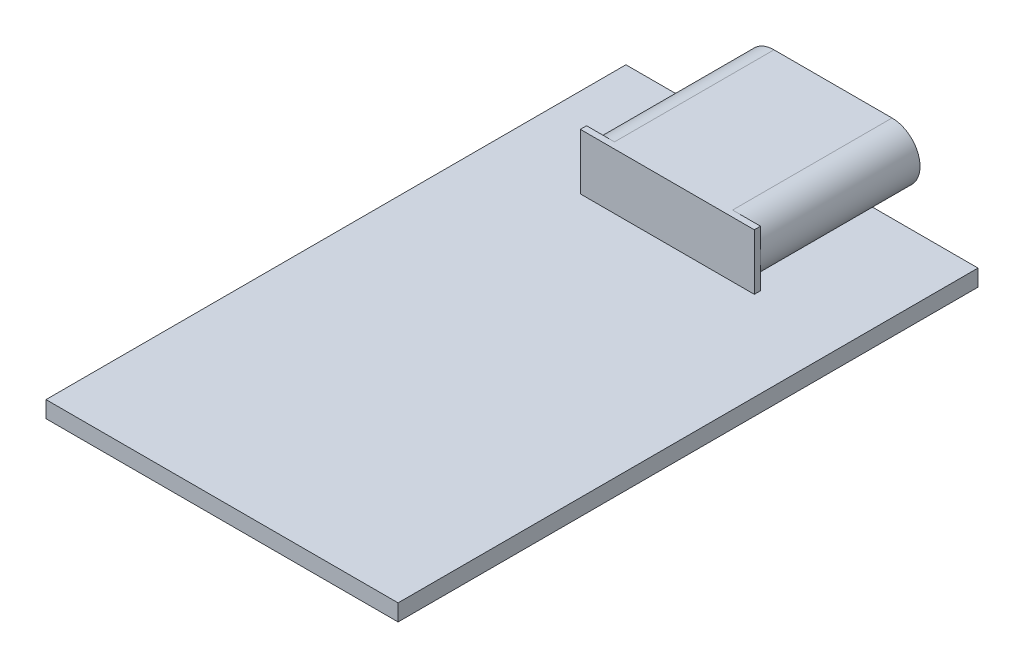
ISO-10303-21;
HEADER;
FILE_DESCRIPTION(('STEP AP214'),'2;1');
FILE_NAME('part.step','',(''),(''),'','','');
FILE_SCHEMA(('AUTOMOTIVE_DESIGN { 1 0 10303 214 1 1 1 1 }'));
ENDSEC;
DATA;
#1=APPLICATION_CONTEXT('core data for automotive mechanical design processes');
#2=APPLICATION_PROTOCOL_DEFINITION('international standard','automotive_design',2000,#1);
#3=PRODUCT_CONTEXT('',#1,'mechanical');
#4=PRODUCT('Part','Part','',(#3));
#5=PRODUCT_RELATED_PRODUCT_CATEGORY('part','',(#4));
#6=PRODUCT_DEFINITION_FORMATION('','',#4);
#7=PRODUCT_DEFINITION_CONTEXT('part definition',#1,'design');
#8=PRODUCT_DEFINITION('design','',#6,#7);
#9=PRODUCT_DEFINITION_SHAPE('','',#8);
#10=(LENGTH_UNIT() NAMED_UNIT(*) SI_UNIT(.MILLI.,.METRE.));
#11=(NAMED_UNIT(*) PLANE_ANGLE_UNIT() SI_UNIT($,.RADIAN.));
#12=(NAMED_UNIT(*) SI_UNIT($,.STERADIAN.) SOLID_ANGLE_UNIT());
#13=UNCERTAINTY_MEASURE_WITH_UNIT(LENGTH_MEASURE(1.E-05),#10,'distance_accuracy_value','');
#14=(GEOMETRIC_REPRESENTATION_CONTEXT(3) GLOBAL_UNCERTAINTY_ASSIGNED_CONTEXT((#13)) GLOBAL_UNIT_ASSIGNED_CONTEXT((#10,
#11,#12)) REPRESENTATION_CONTEXT('',''));
#15=CARTESIAN_POINT('',(0.,0.,0.));
#16=DIRECTION('',(0.,0.,1.));
#17=DIRECTION('',(1.,0.,0.));
#18=AXIS2_PLACEMENT_3D('',#15,#16,#17);
#19=CARTESIAN_POINT('',(4.2,3.5,-15.5));
#20=DIRECTION('',(-1.,0.,0.));
#21=DIRECTION('',(0.,0.,1.));
#22=AXIS2_PLACEMENT_3D('',#19,#20,#21);
#23=PLANE('',#22);
#24=DIRECTION('',(0.,-1.,0.));
#25=VECTOR('',#24,1.);
#26=CARTESIAN_POINT('',(4.2,0.,-7.8));
#27=LINE('',#26,#25);
#28=CARTESIAN_POINT('',(4.2,2.15,-7.8));
#29=VERTEX_POINT('',#28);
#30=CARTESIAN_POINT('',(4.2,0.800000000000001,-7.8));
#31=VERTEX_POINT('',#30);
#32=EDGE_CURVE('E280',#29,#31,#27,.T.);
#33=ORIENTED_EDGE('',*,*,#32,.F.);
#34=DIRECTION('',(0.,-1.,0.));
#35=VECTOR('',#34,1.);
#36=CARTESIAN_POINT('',(4.2,0.,-7.8));
#37=LINE('',#36,#35);
#38=CARTESIAN_POINT('',(4.2,3.5,-7.8));
#39=VERTEX_POINT('',#38);
#40=EDGE_CURVE('E295',#39,#29,#37,.T.);
#41=ORIENTED_EDGE('',*,*,#40,.F.);
#42=DIRECTION('',(0.,0.,-1.));
#43=VECTOR('',#42,1.);
#44=CARTESIAN_POINT('',(4.2,3.5,-15.5));
#45=LINE('',#44,#43);
#46=CARTESIAN_POINT('',(4.2,3.5,-7.5));
#47=VERTEX_POINT('',#46);
#48=EDGE_CURVE('E323',#47,#39,#45,.T.);
#49=ORIENTED_EDGE('',*,*,#48,.F.);
#50=DIRECTION('',(0.,-1.,0.));
#51=VECTOR('',#50,1.);
#52=CARTESIAN_POINT('',(4.2,3.5,-7.5));
#53=LINE('',#52,#51);
#54=CARTESIAN_POINT('',(4.2,0.8,-7.5));
#55=VERTEX_POINT('',#54);
#56=EDGE_CURVE('E337',#47,#55,#53,.T.);
#57=ORIENTED_EDGE('',*,*,#56,.T.);
#58=DIRECTION('',(0.,0.,-1.));
#59=VECTOR('',#58,1.);
#60=CARTESIAN_POINT('',(4.2,0.8,-15.5));
#61=LINE('',#60,#59);
#62=EDGE_CURVE('E298',#55,#31,#61,.T.);
#63=ORIENTED_EDGE('',*,*,#62,.T.);
#64=EDGE_LOOP('',(#33,#41,#49,#57,#63));
#65=FACE_BOUND('',#64,.T.);
#66=ADVANCED_FACE('F127',(#65),#23,.F.);
#67=CARTESIAN_POINT('',(-4.2,3.5,-15.5));
#68=DIRECTION('',(0.,0.,1.));
#69=DIRECTION('',(1.,0.,0.));
#70=AXIS2_PLACEMENT_3D('',#67,#68,#69);
#71=PLANE('',#70);
#72=CARTESIAN_POINT('',(-2.85,2.15,-15.5));
#73=DIRECTION('',(0.,0.,-1.));
#74=DIRECTION('',(-1.,0.,0.));
#75=AXIS2_PLACEMENT_3D('',#72,#73,#74);
#76=CIRCLE('',#75,1.1);
#77=CARTESIAN_POINT('',(-2.85,1.05,-15.5));
#78=VERTEX_POINT('',#77);
#79=CARTESIAN_POINT('',(-2.85,3.25,-15.5));
#80=VERTEX_POINT('',#79);
#81=EDGE_CURVE('E494',#78,#80,#76,.T.);
#82=ORIENTED_EDGE('',*,*,#81,.F.);
#83=DIRECTION('',(-1.,0.,0.));
#84=VECTOR('',#83,1.);
#85=CARTESIAN_POINT('',(0.,1.05,-15.5));
#86=LINE('',#85,#84);
#87=CARTESIAN_POINT('',(2.85,1.05,-15.5));
#88=VERTEX_POINT('',#87);
#89=EDGE_CURVE('E152',#88,#78,#86,.T.);
#90=ORIENTED_EDGE('',*,*,#89,.F.);
#91=CARTESIAN_POINT('',(2.85,2.15,-15.5));
#92=DIRECTION('',(0.,0.,-1.));
#93=DIRECTION('',(-1.,0.,0.));
#94=AXIS2_PLACEMENT_3D('',#91,#92,#93);
#95=CIRCLE('',#94,1.1);
#96=CARTESIAN_POINT('',(2.85,3.25,-15.5));
#97=VERTEX_POINT('',#96);
#98=EDGE_CURVE('E452',#97,#88,#95,.T.);
#99=ORIENTED_EDGE('',*,*,#98,.F.);
#100=DIRECTION('',(-1.,0.,0.));
#101=VECTOR('',#100,1.);
#102=CARTESIAN_POINT('',(0.,3.25,-15.5));
#103=LINE('',#102,#101);
#104=EDGE_CURVE('E498',#97,#80,#103,.T.);
#105=ORIENTED_EDGE('',*,*,#104,.T.);
#106=EDGE_LOOP('',(#82,#90,#99,#105));
#107=FACE_BOUND('',#106,.T.);
#108=CARTESIAN_POINT('',(2.85,2.15,-15.5));
#109=DIRECTION('',(0.,0.,-1.));
#110=DIRECTION('',(-1.,0.,0.));
#111=AXIS2_PLACEMENT_3D('',#108,#109,#110);
#112=CIRCLE('',#111,1.35);
#113=CARTESIAN_POINT('',(2.85,3.5,-15.5));
#114=VERTEX_POINT('',#113);
#115=CARTESIAN_POINT('',(2.85,0.8,-15.5));
#116=VERTEX_POINT('',#115);
#117=EDGE_CURVE('E310',#114,#116,#112,.T.);
#118=ORIENTED_EDGE('',*,*,#117,.T.);
#119=DIRECTION('',(-1.,0.,0.));
#120=VECTOR('',#119,1.);
#121=CARTESIAN_POINT('',(-4.2,0.8,-15.5));
#122=LINE('',#121,#120);
#123=CARTESIAN_POINT('',(-2.85,0.8,-15.5));
#124=VERTEX_POINT('',#123);
#125=EDGE_CURVE('E340',#116,#124,#122,.T.);
#126=ORIENTED_EDGE('',*,*,#125,.T.);
#127=CARTESIAN_POINT('',(-2.85,2.15,-15.5));
#128=DIRECTION('',(0.,0.,-1.));
#129=DIRECTION('',(-1.,0.,0.));
#130=AXIS2_PLACEMENT_3D('',#127,#128,#129);
#131=CIRCLE('',#130,1.35);
#132=CARTESIAN_POINT('',(-2.85,3.5,-15.5));
#133=VERTEX_POINT('',#132);
#134=EDGE_CURVE('E508',#124,#133,#131,.T.);
#135=ORIENTED_EDGE('',*,*,#134,.T.);
#136=DIRECTION('',(-1.,0.,0.));
#137=VECTOR('',#136,1.);
#138=CARTESIAN_POINT('',(-4.2,3.5,-15.5));
#139=LINE('',#138,#137);
#140=EDGE_CURVE('E326',#114,#133,#139,.T.);
#141=ORIENTED_EDGE('',*,*,#140,.F.);
#142=EDGE_LOOP('',(#118,#126,#135,#141));
#143=FACE_BOUND('',#142,.T.);
#144=ADVANCED_FACE('F551',(#107,#143),#71,.F.);
#145=CARTESIAN_POINT('',(0.,0.8,0.));
#146=DIRECTION('',(0.,1.,0.));
#147=DIRECTION('',(0.,0.,1.));
#148=AXIS2_PLACEMENT_3D('',#145,#146,#147);
#149=PLANE('',#148);
#150=DIRECTION('',(0.,0.,-1.));
#151=VECTOR('',#150,1.);
#152=CARTESIAN_POINT('',(2.85,0.8,-7.8));
#153=LINE('',#152,#151);
#154=CARTESIAN_POINT('',(2.85,0.8,-14.));
#155=VERTEX_POINT('',#154);
#156=EDGE_CURVE('E428',#155,#116,#153,.T.);
#157=ORIENTED_EDGE('',*,*,#156,.F.);
#158=DIRECTION('',(-1.,0.,0.));
#159=VECTOR('',#158,1.);
#160=CARTESIAN_POINT('',(-8.5,0.8,-14.));
#161=LINE('',#160,#159);
#162=CARTESIAN_POINT('',(-2.85,0.8,-14.));
#163=VERTEX_POINT('',#162);
#164=EDGE_CURVE('E364',#155,#163,#161,.T.);
#165=ORIENTED_EDGE('',*,*,#164,.T.);
#166=DIRECTION('',(0.,0.,-1.));
#167=VECTOR('',#166,1.);
#168=CARTESIAN_POINT('',(-2.85,0.8,-7.8));
#169=LINE('',#168,#167);
#170=EDGE_CURVE('E426',#163,#124,#169,.T.);
#171=ORIENTED_EDGE('',*,*,#170,.T.);
#172=ORIENTED_EDGE('',*,*,#125,.F.);
#173=EDGE_LOOP('',(#157,#165,#171,#172));
#174=FACE_BOUND('',#173,.T.);
#175=ADVANCED_FACE('F424',(#174),#149,.F.);
#176=CARTESIAN_POINT('',(-4.2,3.5,-15.5));
#177=DIRECTION('',(1.,0.,0.));
#178=DIRECTION('',(0.,0.,-1.));
#179=AXIS2_PLACEMENT_3D('',#176,#177,#178);
#180=PLANE('',#179);
#181=DIRECTION('',(0.,1.,0.));
#182=VECTOR('',#181,1.);
#183=CARTESIAN_POINT('',(-4.2,0.,-7.8));
#184=LINE('',#183,#182);
#185=CARTESIAN_POINT('',(-4.2,0.800000000000001,-7.8));
#186=VERTEX_POINT('',#185);
#187=CARTESIAN_POINT('',(-4.2,2.15,-7.8));
#188=VERTEX_POINT('',#187);
#189=EDGE_CURVE('E443',#186,#188,#184,.T.);
#190=ORIENTED_EDGE('',*,*,#189,.F.);
#191=DIRECTION('',(0.,0.,1.));
#192=VECTOR('',#191,1.);
#193=CARTESIAN_POINT('',(-4.2,0.8,-15.5));
#194=LINE('',#193,#192);
#195=CARTESIAN_POINT('',(-4.2,0.8,-7.5));
#196=VERTEX_POINT('',#195);
#197=EDGE_CURVE('E12',#186,#196,#194,.T.);
#198=ORIENTED_EDGE('',*,*,#197,.T.);
#199=DIRECTION('',(0.,-1.,0.));
#200=VECTOR('',#199,1.);
#201=CARTESIAN_POINT('',(-4.2,3.5,-7.5));
#202=LINE('',#201,#200);
#203=CARTESIAN_POINT('',(-4.2,3.5,-7.5));
#204=VERTEX_POINT('',#203);
#205=EDGE_CURVE('E349',#204,#196,#202,.T.);
#206=ORIENTED_EDGE('',*,*,#205,.F.);
#207=DIRECTION('',(0.,0.,1.));
#208=VECTOR('',#207,1.);
#209=CARTESIAN_POINT('',(-4.2,3.5,-15.5));
#210=LINE('',#209,#208);
#211=CARTESIAN_POINT('',(-4.2,3.5,-7.8));
#212=VERTEX_POINT('',#211);
#213=EDGE_CURVE('E331',#212,#204,#210,.T.);
#214=ORIENTED_EDGE('',*,*,#213,.F.);
#215=DIRECTION('',(0.,1.,0.));
#216=VECTOR('',#215,1.);
#217=CARTESIAN_POINT('',(-4.2,0.,-7.8));
#218=LINE('',#217,#216);
#219=EDGE_CURVE('E532',#188,#212,#218,.T.);
#220=ORIENTED_EDGE('',*,*,#219,.F.);
#221=EDGE_LOOP('',(#190,#198,#206,#214,#220));
#222=FACE_BOUND('',#221,.T.);
#223=ADVANCED_FACE('F562',(#222),#180,.F.);
#224=CARTESIAN_POINT('',(0.,3.5,0.));
#225=DIRECTION('',(0.,1.,0.));
#226=DIRECTION('',(0.,0.,1.));
#227=AXIS2_PLACEMENT_3D('',#224,#225,#226);
#228=PLANE('',#227);
#229=DIRECTION('',(0.,0.,-1.));
#230=VECTOR('',#229,1.);
#231=CARTESIAN_POINT('',(-2.85,3.5,-7.8));
#232=LINE('',#231,#230);
#233=CARTESIAN_POINT('',(-2.85,3.5,-7.8));
#234=VERTEX_POINT('',#233);
#235=EDGE_CURVE('E321',#234,#133,#232,.T.);
#236=ORIENTED_EDGE('',*,*,#235,.F.);
#237=DIRECTION('',(1.,0.,0.));
#238=VECTOR('',#237,1.);
#239=CARTESIAN_POINT('',(0.,3.5,-7.8));
#240=LINE('',#239,#238);
#241=EDGE_CURVE('E535',#212,#234,#240,.T.);
#242=ORIENTED_EDGE('',*,*,#241,.F.);
#243=ORIENTED_EDGE('',*,*,#213,.T.);
#244=DIRECTION('',(1.,0.,0.));
#245=VECTOR('',#244,1.);
#246=CARTESIAN_POINT('',(-4.2,3.5,-7.5));
#247=LINE('',#246,#245);
#248=EDGE_CURVE('E334',#204,#47,#247,.T.);
#249=ORIENTED_EDGE('',*,*,#248,.T.);
#250=ORIENTED_EDGE('',*,*,#48,.T.);
#251=DIRECTION('',(1.,0.,0.));
#252=VECTOR('',#251,1.);
#253=CARTESIAN_POINT('',(0.,3.5,-7.8));
#254=LINE('',#253,#252);
#255=CARTESIAN_POINT('',(2.85,3.5,-7.8));
#256=VERTEX_POINT('',#255);
#257=EDGE_CURVE('E309',#256,#39,#254,.T.);
#258=ORIENTED_EDGE('',*,*,#257,.F.);
#259=DIRECTION('',(0.,0.,-1.));
#260=VECTOR('',#259,1.);
#261=CARTESIAN_POINT('',(2.85,3.5,-7.8));
#262=LINE('',#261,#260);
#263=EDGE_CURVE('E305',#256,#114,#262,.T.);
#264=ORIENTED_EDGE('',*,*,#263,.T.);
#265=ORIENTED_EDGE('',*,*,#140,.T.);
#266=EDGE_LOOP('',(#236,#242,#243,#249,#250,#258,#264,#265));
#267=FACE_BOUND('',#266,.T.);
#268=ADVANCED_FACE('F552',(#267),#228,.T.);
#269=CARTESIAN_POINT('',(0.,0.8,0.));
#270=DIRECTION('',(0.,-1.,0.));
#271=DIRECTION('',(0.,0.,-1.));
#272=AXIS2_PLACEMENT_3D('',#269,#270,#271);
#273=PLANE('',#272);
#274=ORIENTED_EDGE('',*,*,#62,.F.);
#275=DIRECTION('',(1.,0.,0.));
#276=VECTOR('',#275,1.);
#277=CARTESIAN_POINT('',(-4.2,0.8,-7.5));
#278=LINE('',#277,#276);
#279=EDGE_CURVE('E327',#196,#55,#278,.T.);
#280=ORIENTED_EDGE('',*,*,#279,.F.);
#281=ORIENTED_EDGE('',*,*,#197,.F.);
#282=DIRECTION('',(-1.,0.,0.));
#283=VECTOR('',#282,1.);
#284=CARTESIAN_POINT('',(0.,0.8,-7.8));
#285=LINE('',#284,#283);
#286=CARTESIAN_POINT('',(-2.85,0.8,-7.8));
#287=VERTEX_POINT('',#286);
#288=EDGE_CURVE('E440',#287,#186,#285,.T.);
#289=ORIENTED_EDGE('',*,*,#288,.F.);
#290=EDGE_CURVE('E288',#287,#163,#169,.T.);
#291=ORIENTED_EDGE('',*,*,#290,.T.);
#292=CARTESIAN_POINT('',(-8.5,0.8,-14.));
#293=VERTEX_POINT('',#292);
#294=EDGE_CURVE('E358',#163,#293,#161,.T.);
#295=ORIENTED_EDGE('',*,*,#294,.T.);
#296=DIRECTION('',(0.,0.,1.));
#297=VECTOR('',#296,1.);
#298=CARTESIAN_POINT('',(-8.5,0.8,14.));
#299=LINE('',#298,#297);
#300=CARTESIAN_POINT('',(-8.5,0.8,14.));
#301=VERTEX_POINT('',#300);
#302=EDGE_CURVE('E363',#293,#301,#299,.T.);
#303=ORIENTED_EDGE('',*,*,#302,.T.);
#304=DIRECTION('',(1.,0.,0.));
#305=VECTOR('',#304,1.);
#306=CARTESIAN_POINT('',(-8.5,0.8,14.));
#307=LINE('',#306,#305);
#308=CARTESIAN_POINT('',(8.5,0.8,14.));
#309=VERTEX_POINT('',#308);
#310=EDGE_CURVE('E367',#301,#309,#307,.T.);
#311=ORIENTED_EDGE('',*,*,#310,.T.);
#312=DIRECTION('',(0.,0.,-1.));
#313=VECTOR('',#312,1.);
#314=CARTESIAN_POINT('',(8.5,0.8,14.));
#315=LINE('',#314,#313);
#316=CARTESIAN_POINT('',(8.5,0.8,-14.));
#317=VERTEX_POINT('',#316);
#318=EDGE_CURVE('E354',#309,#317,#315,.T.);
#319=ORIENTED_EDGE('',*,*,#318,.T.);
#320=EDGE_CURVE('E360',#317,#155,#161,.T.);
#321=ORIENTED_EDGE('',*,*,#320,.T.);
#322=CARTESIAN_POINT('',(2.85,0.8,-7.8));
#323=VERTEX_POINT('',#322);
#324=EDGE_CURVE('E430',#323,#155,#153,.T.);
#325=ORIENTED_EDGE('',*,*,#324,.F.);
#326=DIRECTION('',(-1.,0.,0.));
#327=VECTOR('',#326,1.);
#328=CARTESIAN_POINT('',(0.,0.8,-7.8));
#329=LINE('',#328,#327);
#330=EDGE_CURVE('E282',#31,#323,#329,.T.);
#331=ORIENTED_EDGE('',*,*,#330,.F.);
#332=EDGE_LOOP('',(#274,#280,#281,#289,#291,#295,#303,#311,#319,#321,#325,#331));
#333=FACE_BOUND('',#332,.T.);
#334=ADVANCED_FACE('F414',(#333),#273,.F.);
#335=CARTESIAN_POINT('',(8.5,0.8,14.));
#336=DIRECTION('',(-1.,0.,0.));
#337=DIRECTION('',(0.,0.,1.));
#338=AXIS2_PLACEMENT_3D('',#335,#336,#337);
#339=PLANE('',#338);
#340=DIRECTION('',(0.,0.,-1.));
#341=VECTOR('',#340,1.);
#342=CARTESIAN_POINT('',(8.5,0.,14.));
#343=LINE('',#342,#341);
#344=CARTESIAN_POINT('',(8.5,0.,14.));
#345=VERTEX_POINT('',#344);
#346=CARTESIAN_POINT('',(8.5,0.,-14.));
#347=VERTEX_POINT('',#346);
#348=EDGE_CURVE('E353',#345,#347,#343,.T.);
#349=ORIENTED_EDGE('',*,*,#348,.T.);
#350=DIRECTION('',(0.,-1.,0.));
#351=VECTOR('',#350,1.);
#352=CARTESIAN_POINT('',(8.5,0.8,-14.));
#353=LINE('',#352,#351);
#354=EDGE_CURVE('E131',#317,#347,#353,.T.);
#355=ORIENTED_EDGE('',*,*,#354,.F.);
#356=ORIENTED_EDGE('',*,*,#318,.F.);
#357=DIRECTION('',(0.,-1.,0.));
#358=VECTOR('',#357,1.);
#359=CARTESIAN_POINT('',(8.5,0.8,14.));
#360=LINE('',#359,#358);
#361=EDGE_CURVE('E370',#309,#345,#360,.T.);
#362=ORIENTED_EDGE('',*,*,#361,.T.);
#363=EDGE_LOOP('',(#349,#355,#356,#362));
#364=FACE_BOUND('',#363,.T.);
#365=ADVANCED_FACE('F129',(#364),#339,.F.);
#366=CARTESIAN_POINT('',(-8.5,0.8,-14.));
#367=DIRECTION('',(0.,0.,1.));
#368=DIRECTION('',(1.,0.,0.));
#369=AXIS2_PLACEMENT_3D('',#366,#367,#368);
#370=PLANE('',#369);
#371=DIRECTION('',(-1.,0.,0.));
#372=VECTOR('',#371,1.);
#373=CARTESIAN_POINT('',(-8.5,0.,-14.));
#374=LINE('',#373,#372);
#375=CARTESIAN_POINT('',(-8.5,0.,-14.));
#376=VERTEX_POINT('',#375);
#377=EDGE_CURVE('E374',#347,#376,#374,.T.);
#378=ORIENTED_EDGE('',*,*,#377,.T.);
#379=DIRECTION('',(0.,-1.,0.));
#380=VECTOR('',#379,1.);
#381=CARTESIAN_POINT('',(-8.5,0.8,-14.));
#382=LINE('',#381,#380);
#383=EDGE_CURVE('E388',#293,#376,#382,.T.);
#384=ORIENTED_EDGE('',*,*,#383,.F.);
#385=ORIENTED_EDGE('',*,*,#294,.F.);
#386=ORIENTED_EDGE('',*,*,#164,.F.);
#387=ORIENTED_EDGE('',*,*,#320,.F.);
#388=ORIENTED_EDGE('',*,*,#354,.T.);
#389=EDGE_LOOP('',(#378,#384,#385,#386,#387,#388));
#390=FACE_BOUND('',#389,.T.);
#391=ADVANCED_FACE('F399',(#390),#370,.F.);
#392=CARTESIAN_POINT('',(-8.5,0.8,14.));
#393=DIRECTION('',(1.,0.,0.));
#394=DIRECTION('',(0.,0.,-1.));
#395=AXIS2_PLACEMENT_3D('',#392,#393,#394);
#396=PLANE('',#395);
#397=DIRECTION('',(0.,0.,1.));
#398=VECTOR('',#397,1.);
#399=CARTESIAN_POINT('',(-8.5,0.,14.));
#400=LINE('',#399,#398);
#401=CARTESIAN_POINT('',(-8.5,0.,14.));
#402=VERTEX_POINT('',#401);
#403=EDGE_CURVE('E377',#376,#402,#400,.T.);
#404=ORIENTED_EDGE('',*,*,#403,.T.);
#405=DIRECTION('',(0.,-1.,0.));
#406=VECTOR('',#405,1.);
#407=CARTESIAN_POINT('',(-8.5,0.8,14.));
#408=LINE('',#407,#406);
#409=EDGE_CURVE('E385',#301,#402,#408,.T.);
#410=ORIENTED_EDGE('',*,*,#409,.F.);
#411=ORIENTED_EDGE('',*,*,#302,.F.);
#412=ORIENTED_EDGE('',*,*,#383,.T.);
#413=EDGE_LOOP('',(#404,#410,#411,#412));
#414=FACE_BOUND('',#413,.T.);
#415=ADVANCED_FACE('F409',(#414),#396,.F.);
#416=CARTESIAN_POINT('',(-8.5,0.8,14.));
#417=DIRECTION('',(0.,0.,-1.));
#418=DIRECTION('',(-1.,0.,0.));
#419=AXIS2_PLACEMENT_3D('',#416,#417,#418);
#420=PLANE('',#419);
#421=DIRECTION('',(1.,0.,0.));
#422=VECTOR('',#421,1.);
#423=CARTESIAN_POINT('',(-8.5,0.,14.));
#424=LINE('',#423,#422);
#425=EDGE_CURVE('E359',#402,#345,#424,.T.);
#426=ORIENTED_EDGE('',*,*,#425,.T.);
#427=ORIENTED_EDGE('',*,*,#361,.F.);
#428=ORIENTED_EDGE('',*,*,#310,.F.);
#429=ORIENTED_EDGE('',*,*,#409,.T.);
#430=EDGE_LOOP('',(#426,#427,#428,#429));
#431=FACE_BOUND('',#430,.T.);
#432=ADVANCED_FACE('F412',(#431),#420,.F.);
#433=CARTESIAN_POINT('',(0.,0.,0.));
#434=DIRECTION('',(0.,-1.,0.));
#435=DIRECTION('',(0.,0.,-1.));
#436=AXIS2_PLACEMENT_3D('',#433,#434,#435);
#437=PLANE('',#436);
#438=ORIENTED_EDGE('',*,*,#348,.F.);
#439=ORIENTED_EDGE('',*,*,#425,.F.);
#440=ORIENTED_EDGE('',*,*,#403,.F.);
#441=ORIENTED_EDGE('',*,*,#377,.F.);
#442=EDGE_LOOP('',(#438,#439,#440,#441));
#443=FACE_BOUND('',#442,.T.);
#444=ADVANCED_FACE('F407',(#443),#437,.T.);
#445=CARTESIAN_POINT('',(-4.2,3.5,-7.5));
#446=DIRECTION('',(0.,0.,-1.));
#447=DIRECTION('',(-1.,0.,0.));
#448=AXIS2_PLACEMENT_3D('',#445,#446,#447);
#449=PLANE('',#448);
#450=ORIENTED_EDGE('',*,*,#279,.T.);
#451=ORIENTED_EDGE('',*,*,#56,.F.);
#452=ORIENTED_EDGE('',*,*,#248,.F.);
#453=ORIENTED_EDGE('',*,*,#205,.T.);
#454=EDGE_LOOP('',(#450,#451,#452,#453));
#455=FACE_BOUND('',#454,.T.);
#456=ADVANCED_FACE('F556',(#455),#449,.F.);
#457=CARTESIAN_POINT('',(2.85,2.15,-7.8));
#458=DIRECTION('',(0.,0.,-1.));
#459=DIRECTION('',(-1.,0.,0.));
#460=AXIS2_PLACEMENT_3D('',#457,#458,#459);
#461=CYLINDRICAL_SURFACE('',#460,1.35);
#462=ORIENTED_EDGE('',*,*,#117,.F.);
#463=ORIENTED_EDGE('',*,*,#263,.F.);
#464=CARTESIAN_POINT('',(2.85,2.15,-7.8));
#465=DIRECTION('',(0.,0.,-1.));
#466=DIRECTION('',(-1.,0.,0.));
#467=AXIS2_PLACEMENT_3D('',#464,#465,#466);
#468=CIRCLE('',#467,1.35);
#469=EDGE_CURVE('E302',#256,#29,#468,.T.);
#470=ORIENTED_EDGE('',*,*,#469,.T.);
#471=CARTESIAN_POINT('',(2.85,2.15,-7.8));
#472=DIRECTION('',(0.,0.,-1.));
#473=DIRECTION('',(-1.,0.,0.));
#474=AXIS2_PLACEMENT_3D('',#471,#472,#473);
#475=CIRCLE('',#474,1.35);
#476=EDGE_CURVE('E277',#29,#323,#475,.T.);
#477=ORIENTED_EDGE('',*,*,#476,.T.);
#478=ORIENTED_EDGE('',*,*,#324,.T.);
#479=ORIENTED_EDGE('',*,*,#156,.T.);
#480=EDGE_LOOP('',(#462,#463,#470,#477,#478,#479));
#481=FACE_BOUND('',#480,.T.);
#482=ADVANCED_FACE('F303',(#481),#461,.T.);
#483=CARTESIAN_POINT('',(0.,0.,-7.8));
#484=DIRECTION('',(0.,0.,-1.));
#485=DIRECTION('',(-1.,0.,0.));
#486=AXIS2_PLACEMENT_3D('',#483,#484,#485);
#487=PLANE('',#486);
#488=ORIENTED_EDGE('',*,*,#469,.F.);
#489=ORIENTED_EDGE('',*,*,#257,.T.);
#490=ORIENTED_EDGE('',*,*,#40,.T.);
#491=EDGE_LOOP('',(#488,#489,#490));
#492=FACE_BOUND('',#491,.T.);
#493=ADVANCED_FACE('F312',(#492),#487,.T.);
#494=CARTESIAN_POINT('',(-2.85,2.15,-7.8));
#495=DIRECTION('',(0.,0.,-1.));
#496=DIRECTION('',(-1.,0.,0.));
#497=AXIS2_PLACEMENT_3D('',#494,#495,#496);
#498=CYLINDRICAL_SURFACE('',#497,1.35);
#499=ORIENTED_EDGE('',*,*,#134,.F.);
#500=ORIENTED_EDGE('',*,*,#170,.F.);
#501=ORIENTED_EDGE('',*,*,#290,.F.);
#502=CARTESIAN_POINT('',(-2.85,2.15,-7.8));
#503=DIRECTION('',(0.,0.,-1.));
#504=DIRECTION('',(-1.,0.,0.));
#505=AXIS2_PLACEMENT_3D('',#502,#503,#504);
#506=CIRCLE('',#505,1.35);
#507=EDGE_CURVE('E436',#287,#188,#506,.T.);
#508=ORIENTED_EDGE('',*,*,#507,.T.);
#509=CARTESIAN_POINT('',(-2.85,2.15,-7.8));
#510=DIRECTION('',(0.,0.,-1.));
#511=DIRECTION('',(-1.,0.,0.));
#512=AXIS2_PLACEMENT_3D('',#509,#510,#511);
#513=CIRCLE('',#512,1.35);
#514=EDGE_CURVE('E529',#188,#234,#513,.T.);
#515=ORIENTED_EDGE('',*,*,#514,.T.);
#516=ORIENTED_EDGE('',*,*,#235,.T.);
#517=EDGE_LOOP('',(#499,#500,#501,#508,#515,#516));
#518=FACE_BOUND('',#517,.T.);
#519=ADVANCED_FACE('F545',(#518),#498,.T.);
#520=CARTESIAN_POINT('',(0.,0.,-7.8));
#521=DIRECTION('',(0.,0.,-1.));
#522=DIRECTION('',(-1.,0.,0.));
#523=AXIS2_PLACEMENT_3D('',#520,#521,#522);
#524=PLANE('',#523);
#525=ORIENTED_EDGE('',*,*,#514,.F.);
#526=ORIENTED_EDGE('',*,*,#219,.T.);
#527=ORIENTED_EDGE('',*,*,#241,.T.);
#528=EDGE_LOOP('',(#525,#526,#527));
#529=FACE_BOUND('',#528,.T.);
#530=ADVANCED_FACE('F569',(#529),#524,.T.);
#531=CARTESIAN_POINT('',(0.,1.05,-7.8));
#532=DIRECTION('',(0.,-1.,0.));
#533=DIRECTION('',(0.,0.,-1.));
#534=AXIS2_PLACEMENT_3D('',#531,#532,#533);
#535=PLANE('',#534);
#536=ORIENTED_EDGE('',*,*,#89,.T.);
#537=DIRECTION('',(0.,0.,-1.));
#538=VECTOR('',#537,1.);
#539=CARTESIAN_POINT('',(-2.85,1.05,-7.8));
#540=LINE('',#539,#538);
#541=CARTESIAN_POINT('',(-2.85,1.05,-7.8));
#542=VERTEX_POINT('',#541);
#543=EDGE_CURVE('E515',#542,#78,#540,.T.);
#544=ORIENTED_EDGE('',*,*,#543,.F.);
#545=DIRECTION('',(-1.,0.,0.));
#546=VECTOR('',#545,1.);
#547=CARTESIAN_POINT('',(0.,1.05,-7.8));
#548=LINE('',#547,#546);
#549=CARTESIAN_POINT('',(2.85,1.05,-7.8));
#550=VERTEX_POINT('',#549);
#551=EDGE_CURVE('E462',#550,#542,#548,.T.);
#552=ORIENTED_EDGE('',*,*,#551,.F.);
#553=DIRECTION('',(0.,0.,-1.));
#554=VECTOR('',#553,1.);
#555=CARTESIAN_POINT('',(2.85,1.05,-7.8));
#556=LINE('',#555,#554);
#557=EDGE_CURVE('E505',#550,#88,#556,.T.);
#558=ORIENTED_EDGE('',*,*,#557,.T.);
#559=EDGE_LOOP('',(#536,#544,#552,#558));
#560=FACE_BOUND('',#559,.T.);
#561=ADVANCED_FACE('F571',(#560),#535,.F.);
#562=CARTESIAN_POINT('',(2.85,2.15,-7.8));
#563=DIRECTION('',(0.,0.,-1.));
#564=DIRECTION('',(-1.,0.,0.));
#565=AXIS2_PLACEMENT_3D('',#562,#563,#564);
#566=CYLINDRICAL_SURFACE('',#565,1.1);
#567=ORIENTED_EDGE('',*,*,#98,.T.);
#568=ORIENTED_EDGE('',*,*,#557,.F.);
#569=CARTESIAN_POINT('',(2.85,2.15,-7.8));
#570=DIRECTION('',(0.,0.,-1.));
#571=DIRECTION('',(-1.,0.,0.));
#572=AXIS2_PLACEMENT_3D('',#569,#570,#571);
#573=CIRCLE('',#572,1.1);
#574=CARTESIAN_POINT('',(2.85,3.25,-7.8));
#575=VERTEX_POINT('',#574);
#576=EDGE_CURVE('E473',#575,#550,#573,.T.);
#577=ORIENTED_EDGE('',*,*,#576,.F.);
#578=DIRECTION('',(0.,0.,-1.));
#579=VECTOR('',#578,1.);
#580=CARTESIAN_POINT('',(2.85,3.25,-7.8));
#581=LINE('',#580,#579);
#582=EDGE_CURVE('E509',#575,#97,#581,.T.);
#583=ORIENTED_EDGE('',*,*,#582,.T.);
#584=EDGE_LOOP('',(#567,#568,#577,#583));
#585=FACE_BOUND('',#584,.T.);
#586=ADVANCED_FACE('F577',(#585),#566,.F.);
#587=CARTESIAN_POINT('',(0.,3.25,-7.8));
#588=DIRECTION('',(0.,-1.,0.));
#589=DIRECTION('',(0.,0.,-1.));
#590=AXIS2_PLACEMENT_3D('',#587,#588,#589);
#591=PLANE('',#590);
#592=ORIENTED_EDGE('',*,*,#104,.F.);
#593=ORIENTED_EDGE('',*,*,#582,.F.);
#594=DIRECTION('',(-1.,0.,0.));
#595=VECTOR('',#594,1.);
#596=CARTESIAN_POINT('',(0.,3.25,-7.8));
#597=LINE('',#596,#595);
#598=CARTESIAN_POINT('',(-2.85,3.25,-7.8));
#599=VERTEX_POINT('',#598);
#600=EDGE_CURVE('E470',#575,#599,#597,.T.);
#601=ORIENTED_EDGE('',*,*,#600,.T.);
#602=DIRECTION('',(0.,0.,-1.));
#603=VECTOR('',#602,1.);
#604=CARTESIAN_POINT('',(-2.85,3.25,-7.8));
#605=LINE('',#604,#603);
#606=EDGE_CURVE('E512',#599,#80,#605,.T.);
#607=ORIENTED_EDGE('',*,*,#606,.T.);
#608=EDGE_LOOP('',(#592,#593,#601,#607));
#609=FACE_BOUND('',#608,.T.);
#610=ADVANCED_FACE('F726',(#609),#591,.T.);
#611=CARTESIAN_POINT('',(-2.85,2.15,-7.8));
#612=DIRECTION('',(0.,0.,-1.));
#613=DIRECTION('',(-1.,0.,0.));
#614=AXIS2_PLACEMENT_3D('',#611,#612,#613);
#615=CYLINDRICAL_SURFACE('',#614,0.35);
#616=CARTESIAN_POINT('',(-2.85,2.15,-15.5));
#617=DIRECTION('',(0.,0.,-1.));
#618=DIRECTION('',(-1.,0.,0.));
#619=AXIS2_PLACEMENT_3D('',#616,#617,#618);
#620=CIRCLE('',#619,0.35);
#621=CARTESIAN_POINT('',(-2.85,1.8,-15.5));
#622=VERTEX_POINT('',#621);
#623=CARTESIAN_POINT('',(-2.85,2.5,-15.5));
#624=VERTEX_POINT('',#623);
#625=EDGE_CURVE('E144',#622,#624,#620,.T.);
#626=ORIENTED_EDGE('',*,*,#625,.F.);
#627=DIRECTION('',(0.,0.,-1.));
#628=VECTOR('',#627,1.);
#629=CARTESIAN_POINT('',(-2.85,1.8,-7.8));
#630=LINE('',#629,#628);
#631=CARTESIAN_POINT('',(-2.85,1.8,-7.8));
#632=VERTEX_POINT('',#631);
#633=EDGE_CURVE('E477',#632,#622,#630,.T.);
#634=ORIENTED_EDGE('',*,*,#633,.F.);
#635=CARTESIAN_POINT('',(-2.85,2.15,-7.8));
#636=DIRECTION('',(0.,0.,-1.));
#637=DIRECTION('',(-1.,0.,0.));
#638=AXIS2_PLACEMENT_3D('',#635,#636,#637);
#639=CIRCLE('',#638,0.35);
#640=CARTESIAN_POINT('',(-2.85,2.5,-7.8));
#641=VERTEX_POINT('',#640);
#642=EDGE_CURVE('E448',#632,#641,#639,.T.);
#643=ORIENTED_EDGE('',*,*,#642,.T.);
#644=DIRECTION('',(0.,0.,-1.));
#645=VECTOR('',#644,1.);
#646=CARTESIAN_POINT('',(-2.85,2.5,-7.8));
#647=LINE('',#646,#645);
#648=EDGE_CURVE('E518',#641,#624,#647,.T.);
#649=ORIENTED_EDGE('',*,*,#648,.T.);
#650=EDGE_LOOP('',(#626,#634,#643,#649));
#651=FACE_BOUND('',#650,.T.);
#652=ADVANCED_FACE('F737',(#651),#615,.T.);
#653=CARTESIAN_POINT('',(0.,2.5,-7.8));
#654=DIRECTION('',(0.,-1.,0.));
#655=DIRECTION('',(0.,0.,-1.));
#656=AXIS2_PLACEMENT_3D('',#653,#654,#655);
#657=PLANE('',#656);
#658=DIRECTION('',(-1.,0.,0.));
#659=VECTOR('',#658,1.);
#660=CARTESIAN_POINT('',(0.,2.5,-15.5));
#661=LINE('',#660,#659);
#662=CARTESIAN_POINT('',(2.85,2.5,-15.5));
#663=VERTEX_POINT('',#662);
#664=EDGE_CURVE('E488',#663,#624,#661,.T.);
#665=ORIENTED_EDGE('',*,*,#664,.T.);
#666=ORIENTED_EDGE('',*,*,#648,.F.);
#667=DIRECTION('',(-1.,0.,0.));
#668=VECTOR('',#667,1.);
#669=CARTESIAN_POINT('',(0.,2.5,-7.8));
#670=LINE('',#669,#668);
#671=CARTESIAN_POINT('',(2.85,2.5,-7.8));
#672=VERTEX_POINT('',#671);
#673=EDGE_CURVE('E458',#672,#641,#670,.T.);
#674=ORIENTED_EDGE('',*,*,#673,.F.);
#675=DIRECTION('',(0.,0.,-1.));
#676=VECTOR('',#675,1.);
#677=CARTESIAN_POINT('',(2.85,2.5,-7.8));
#678=LINE('',#677,#676);
#679=EDGE_CURVE('E521',#672,#663,#678,.T.);
#680=ORIENTED_EDGE('',*,*,#679,.T.);
#681=EDGE_LOOP('',(#665,#666,#674,#680));
#682=FACE_BOUND('',#681,.T.);
#683=ADVANCED_FACE('F748',(#682),#657,.F.);
#684=CARTESIAN_POINT('',(2.85,2.15,-7.8));
#685=DIRECTION('',(0.,0.,-1.));
#686=DIRECTION('',(-1.,0.,0.));
#687=AXIS2_PLACEMENT_3D('',#684,#685,#686);
#688=CYLINDRICAL_SURFACE('',#687,0.35);
#689=CARTESIAN_POINT('',(2.85,2.15,-15.5));
#690=DIRECTION('',(0.,0.,-1.));
#691=DIRECTION('',(-1.,0.,0.));
#692=AXIS2_PLACEMENT_3D('',#689,#690,#691);
#693=CIRCLE('',#692,0.35);
#694=CARTESIAN_POINT('',(2.85,1.8,-15.5));
#695=VERTEX_POINT('',#694);
#696=EDGE_CURVE('E484',#663,#695,#693,.T.);
#697=ORIENTED_EDGE('',*,*,#696,.F.);
#698=ORIENTED_EDGE('',*,*,#679,.F.);
#699=CARTESIAN_POINT('',(2.85,2.15,-7.8));
#700=DIRECTION('',(0.,0.,-1.));
#701=DIRECTION('',(-1.,0.,0.));
#702=AXIS2_PLACEMENT_3D('',#699,#700,#701);
#703=CIRCLE('',#702,0.35);
#704=CARTESIAN_POINT('',(2.85,1.8,-7.8));
#705=VERTEX_POINT('',#704);
#706=EDGE_CURVE('E455',#672,#705,#703,.T.);
#707=ORIENTED_EDGE('',*,*,#706,.T.);
#708=DIRECTION('',(0.,0.,-1.));
#709=VECTOR('',#708,1.);
#710=CARTESIAN_POINT('',(2.85,1.8,-7.8));
#711=LINE('',#710,#709);
#712=EDGE_CURVE('E524',#705,#695,#711,.T.);
#713=ORIENTED_EDGE('',*,*,#712,.T.);
#714=EDGE_LOOP('',(#697,#698,#707,#713));
#715=FACE_BOUND('',#714,.T.);
#716=ADVANCED_FACE('F757',(#715),#688,.T.);
#717=CARTESIAN_POINT('',(0.,1.8,-7.8));
#718=DIRECTION('',(0.,-1.,0.));
#719=DIRECTION('',(0.,0.,-1.));
#720=AXIS2_PLACEMENT_3D('',#717,#718,#719);
#721=PLANE('',#720);
#722=DIRECTION('',(-1.,0.,0.));
#723=VECTOR('',#722,1.);
#724=CARTESIAN_POINT('',(0.,1.8,-15.5));
#725=LINE('',#724,#723);
#726=EDGE_CURVE('E480',#695,#622,#725,.T.);
#727=ORIENTED_EDGE('',*,*,#726,.F.);
#728=ORIENTED_EDGE('',*,*,#712,.F.);
#729=DIRECTION('',(-1.,0.,0.));
#730=VECTOR('',#729,1.);
#731=CARTESIAN_POINT('',(0.,1.8,-7.8));
#732=LINE('',#731,#730);
#733=EDGE_CURVE('E451',#705,#632,#732,.T.);
#734=ORIENTED_EDGE('',*,*,#733,.T.);
#735=ORIENTED_EDGE('',*,*,#633,.T.);
#736=EDGE_LOOP('',(#727,#728,#734,#735));
#737=FACE_BOUND('',#736,.T.);
#738=ADVANCED_FACE('F768',(#737),#721,.T.);
#739=CARTESIAN_POINT('',(-2.85,2.15,-7.8));
#740=DIRECTION('',(0.,0.,-1.));
#741=DIRECTION('',(-1.,0.,0.));
#742=AXIS2_PLACEMENT_3D('',#739,#740,#741);
#743=CYLINDRICAL_SURFACE('',#742,1.1);
#744=ORIENTED_EDGE('',*,*,#81,.T.);
#745=ORIENTED_EDGE('',*,*,#606,.F.);
#746=CARTESIAN_POINT('',(-2.85,2.15,-7.8));
#747=DIRECTION('',(0.,0.,-1.));
#748=DIRECTION('',(-1.,0.,0.));
#749=AXIS2_PLACEMENT_3D('',#746,#747,#748);
#750=CIRCLE('',#749,1.1);
#751=EDGE_CURVE('E466',#542,#599,#750,.T.);
#752=ORIENTED_EDGE('',*,*,#751,.F.);
#753=ORIENTED_EDGE('',*,*,#543,.T.);
#754=EDGE_LOOP('',(#744,#745,#752,#753));
#755=FACE_BOUND('',#754,.T.);
#756=ADVANCED_FACE('F779',(#755),#743,.F.);
#757=CARTESIAN_POINT('',(0.,0.,-7.8));
#758=DIRECTION('',(0.,0.,-1.));
#759=DIRECTION('',(-1.,0.,0.));
#760=AXIS2_PLACEMENT_3D('',#757,#758,#759);
#761=PLANE('',#760);
#762=ORIENTED_EDGE('',*,*,#642,.F.);
#763=ORIENTED_EDGE('',*,*,#733,.F.);
#764=ORIENTED_EDGE('',*,*,#706,.F.);
#765=ORIENTED_EDGE('',*,*,#673,.T.);
#766=EDGE_LOOP('',(#762,#763,#764,#765));
#767=FACE_BOUND('',#766,.T.);
#768=ORIENTED_EDGE('',*,*,#551,.T.);
#769=ORIENTED_EDGE('',*,*,#751,.T.);
#770=ORIENTED_EDGE('',*,*,#600,.F.);
#771=ORIENTED_EDGE('',*,*,#576,.T.);
#772=EDGE_LOOP('',(#768,#769,#770,#771));
#773=FACE_BOUND('',#772,.T.);
#774=ADVANCED_FACE('F790',(#767,#773),#761,.T.);
#775=ORIENTED_EDGE('',*,*,#625,.T.);
#776=ORIENTED_EDGE('',*,*,#664,.F.);
#777=ORIENTED_EDGE('',*,*,#696,.T.);
#778=ORIENTED_EDGE('',*,*,#726,.T.);
#779=EDGE_LOOP('',(#775,#776,#777,#778));
#780=FACE_BOUND('',#779,.T.);
#781=ADVANCED_FACE('F588',(#780),#71,.F.);
#782=CARTESIAN_POINT('',(0.,0.,-7.8));
#783=DIRECTION('',(0.,0.,-1.));
#784=DIRECTION('',(-1.,0.,0.));
#785=AXIS2_PLACEMENT_3D('',#782,#783,#784);
#786=PLANE('',#785);
#787=ORIENTED_EDGE('',*,*,#507,.F.);
#788=ORIENTED_EDGE('',*,*,#288,.T.);
#789=ORIENTED_EDGE('',*,*,#189,.T.);
#790=EDGE_LOOP('',(#787,#788,#789));
#791=FACE_BOUND('',#790,.T.);
#792=ADVANCED_FACE('F567',(#791),#786,.T.);
#793=CARTESIAN_POINT('',(0.,0.,-7.8));
#794=DIRECTION('',(0.,0.,-1.));
#795=DIRECTION('',(-1.,0.,0.));
#796=AXIS2_PLACEMENT_3D('',#793,#794,#795);
#797=PLANE('',#796);
#798=ORIENTED_EDGE('',*,*,#476,.F.);
#799=ORIENTED_EDGE('',*,*,#32,.T.);
#800=ORIENTED_EDGE('',*,*,#330,.T.);
#801=EDGE_LOOP('',(#798,#799,#800));
#802=FACE_BOUND('',#801,.T.);
#803=ADVANCED_FACE('F279',(#802),#797,.T.);
#804=CLOSED_SHELL('',(#66,#144,#175,#223,#268,#334,#365,#391,#415,#432,#444,#456,#482,#493,#519,
#530,#561,#586,#610,#652,#683,#716,#738,#756,#774,#781,#792,#803));
#805=MANIFOLD_SOLID_BREP('B2',#804);
#806=ADVANCED_BREP_SHAPE_REPRESENTATION('',(#18,#805),#14);
#807=SHAPE_DEFINITION_REPRESENTATION(#9,#806);
ENDSEC;
END-ISO-10303-21;
